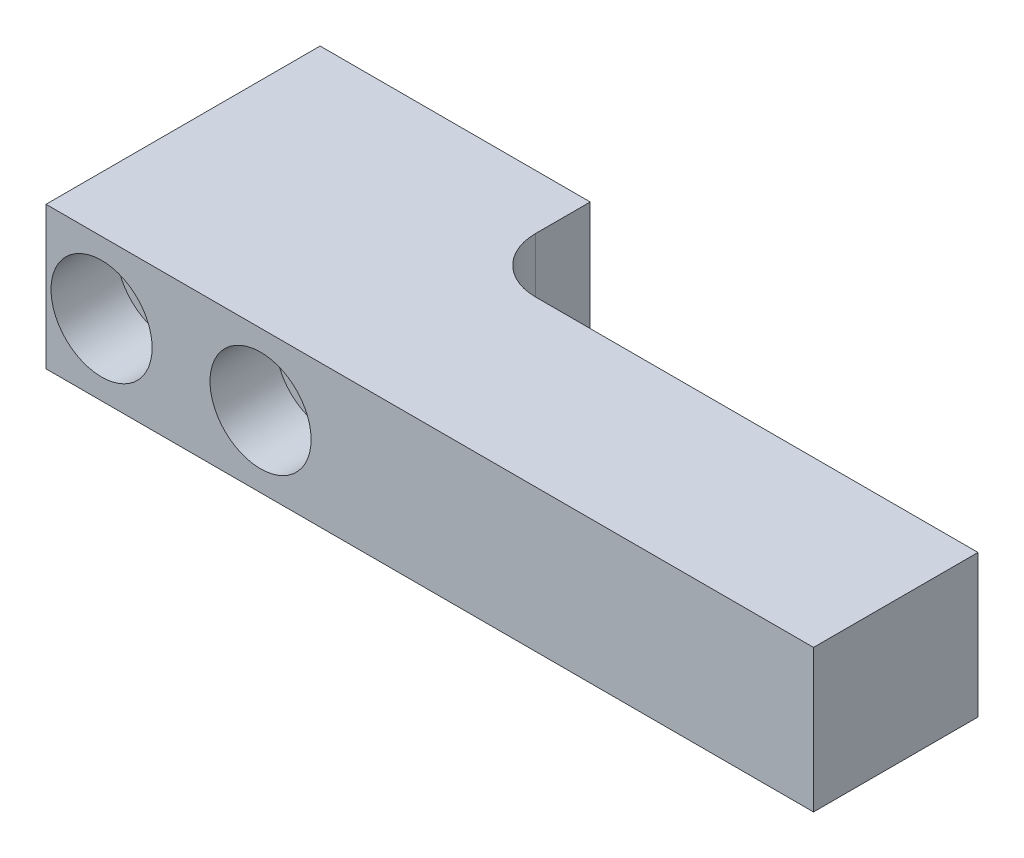
ISO-10303-21;
HEADER;
FILE_DESCRIPTION(('STEP AP214'),'2;1');
FILE_NAME('part.step','',(''),(''),'','','');
FILE_SCHEMA(('AUTOMOTIVE_DESIGN { 1 0 10303 214 1 1 1 1 }'));
ENDSEC;
DATA;
#1=APPLICATION_CONTEXT('core data for automotive mechanical design processes');
#2=APPLICATION_PROTOCOL_DEFINITION('international standard','automotive_design',2000,#1);
#3=PRODUCT_CONTEXT('',#1,'mechanical');
#4=PRODUCT('Part','Part','',(#3));
#5=PRODUCT_RELATED_PRODUCT_CATEGORY('part','',(#4));
#6=PRODUCT_DEFINITION_FORMATION('','',#4);
#7=PRODUCT_DEFINITION_CONTEXT('part definition',#1,'design');
#8=PRODUCT_DEFINITION('design','',#6,#7);
#9=PRODUCT_DEFINITION_SHAPE('','',#8);
#10=(LENGTH_UNIT() NAMED_UNIT(*) SI_UNIT(.MILLI.,.METRE.));
#11=(NAMED_UNIT(*) PLANE_ANGLE_UNIT() SI_UNIT($,.RADIAN.));
#12=(NAMED_UNIT(*) SI_UNIT($,.STERADIAN.) SOLID_ANGLE_UNIT());
#13=UNCERTAINTY_MEASURE_WITH_UNIT(LENGTH_MEASURE(1.E-05),#10,'distance_accuracy_value','');
#14=(GEOMETRIC_REPRESENTATION_CONTEXT(3) GLOBAL_UNCERTAINTY_ASSIGNED_CONTEXT((#13)) GLOBAL_UNIT_ASSIGNED_CONTEXT((#10,
#11,#12)) REPRESENTATION_CONTEXT('',''));
#15=CARTESIAN_POINT('',(0.,0.,0.));
#16=DIRECTION('',(0.,0.,1.));
#17=DIRECTION('',(1.,0.,0.));
#18=AXIS2_PLACEMENT_3D('',#15,#16,#17);
#19=CARTESIAN_POINT('',(19.567,6.5,25.));
#20=DIRECTION('',(0.,0.,-1.));
#21=DIRECTION('',(-1.,0.,0.));
#22=AXIS2_PLACEMENT_3D('',#19,#20,#21);
#23=CYLINDRICAL_SURFACE('',#22,2.68);
#24=CARTESIAN_POINT('',(19.567,6.5,0.));
#25=DIRECTION('',(0.,0.,-1.));
#26=DIRECTION('',(-1.,0.,0.));
#27=AXIS2_PLACEMENT_3D('',#24,#25,#26);
#28=CIRCLE('',#27,2.68);
#29=CARTESIAN_POINT('',(16.887,6.5,0.));
#30=VERTEX_POINT('',#29);
#31=EDGE_CURVE('E135',#30,#30,#28,.T.);
#32=ORIENTED_EDGE('',*,*,#31,.T.);
#33=EDGE_LOOP('',(#32));
#34=FACE_BOUND('',#33,.T.);
#35=CARTESIAN_POINT('',(19.567,6.5,19.));
#36=DIRECTION('',(0.,0.,1.));
#37=DIRECTION('',(1.,0.,0.));
#38=AXIS2_PLACEMENT_3D('',#35,#36,#37);
#39=CIRCLE('',#38,2.68);
#40=CARTESIAN_POINT('',(22.247,6.5,19.));
#41=VERTEX_POINT('',#40);
#42=EDGE_CURVE('E43',#41,#41,#39,.F.);
#43=ORIENTED_EDGE('',*,*,#42,.F.);
#44=EDGE_LOOP('',(#43));
#45=FACE_BOUND('',#44,.T.);
#46=ADVANCED_FACE('F39',(#34,#45),#23,.F.);
#47=CARTESIAN_POINT('',(5.067,6.5,25.));
#48=DIRECTION('',(0.,0.,-1.));
#49=DIRECTION('',(-1.,0.,0.));
#50=AXIS2_PLACEMENT_3D('',#47,#48,#49);
#51=CYLINDRICAL_SURFACE('',#50,2.68);
#52=CARTESIAN_POINT('',(5.067,6.5,0.));
#53=DIRECTION('',(0.,0.,-1.));
#54=DIRECTION('',(-1.,0.,0.));
#55=AXIS2_PLACEMENT_3D('',#52,#53,#54);
#56=CIRCLE('',#55,2.68);
#57=CARTESIAN_POINT('',(2.387,6.5,0.));
#58=VERTEX_POINT('',#57);
#59=EDGE_CURVE('E146',#58,#58,#56,.T.);
#60=ORIENTED_EDGE('',*,*,#59,.T.);
#61=EDGE_LOOP('',(#60));
#62=FACE_BOUND('',#61,.T.);
#63=CARTESIAN_POINT('',(5.067,6.5,19.));
#64=DIRECTION('',(0.,0.,1.));
#65=DIRECTION('',(1.,0.,0.));
#66=AXIS2_PLACEMENT_3D('',#63,#64,#65);
#67=CIRCLE('',#66,2.68);
#68=CARTESIAN_POINT('',(7.747,6.5,19.));
#69=VERTEX_POINT('',#68);
#70=EDGE_CURVE('E180',#69,#69,#67,.F.);
#71=ORIENTED_EDGE('',*,*,#70,.F.);
#72=EDGE_LOOP('',(#71));
#73=FACE_BOUND('',#72,.T.);
#74=ADVANCED_FACE('F243',(#62,#73),#51,.F.);
#75=CARTESIAN_POINT('',(0.,13.,10.));
#76=DIRECTION('',(1.,0.,0.));
#77=DIRECTION('',(0.,0.,-1.));
#78=AXIS2_PLACEMENT_3D('',#75,#76,#77);
#79=PLANE('',#78);
#80=DIRECTION('',(0.,-1.,0.));
#81=VECTOR('',#80,1.);
#82=CARTESIAN_POINT('',(0.,13.,0.));
#83=LINE('',#82,#81);
#84=CARTESIAN_POINT('',(0.,13.,0.));
#85=VERTEX_POINT('',#84);
#86=CARTESIAN_POINT('',(0.,0.,0.));
#87=VERTEX_POINT('',#86);
#88=EDGE_CURVE('E107',#85,#87,#83,.T.);
#89=ORIENTED_EDGE('',*,*,#88,.T.);
#90=DIRECTION('',(0.,0.,-1.));
#91=VECTOR('',#90,1.);
#92=CARTESIAN_POINT('',(0.,0.,10.));
#93=LINE('',#92,#91);
#94=CARTESIAN_POINT('',(0.,0.,25.));
#95=VERTEX_POINT('',#94);
#96=EDGE_CURVE('E100',#95,#87,#93,.T.);
#97=ORIENTED_EDGE('',*,*,#96,.F.);
#98=DIRECTION('',(0.,-1.,0.));
#99=VECTOR('',#98,1.);
#100=CARTESIAN_POINT('',(0.,0.,25.));
#101=LINE('',#100,#99);
#102=CARTESIAN_POINT('',(0.,13.,25.));
#103=VERTEX_POINT('',#102);
#104=EDGE_CURVE('E105',#103,#95,#101,.T.);
#105=ORIENTED_EDGE('',*,*,#104,.F.);
#106=DIRECTION('',(0.,0.,-1.));
#107=VECTOR('',#106,1.);
#108=CARTESIAN_POINT('',(0.,13.,10.));
#109=LINE('',#108,#107);
#110=EDGE_CURVE('E166',#103,#85,#109,.T.);
#111=ORIENTED_EDGE('',*,*,#110,.T.);
#112=EDGE_LOOP('',(#89,#97,#105,#111));
#113=FACE_BOUND('',#112,.T.);
#114=ADVANCED_FACE('F102',(#113),#79,.F.);
#115=CARTESIAN_POINT('',(0.,0.,10.));
#116=DIRECTION('',(0.,1.,0.));
#117=DIRECTION('',(0.,0.,1.));
#118=AXIS2_PLACEMENT_3D('',#115,#116,#117);
#119=PLANE('',#118);
#120=DIRECTION('',(1.,0.,0.));
#121=VECTOR('',#120,1.);
#122=CARTESIAN_POINT('',(0.,0.,0.));
#123=LINE('',#122,#121);
#124=CARTESIAN_POINT('',(24.634,0.,0.));
#125=VERTEX_POINT('',#124);
#126=EDGE_CURVE('E156',#87,#125,#123,.T.);
#127=ORIENTED_EDGE('',*,*,#126,.T.);
#128=DIRECTION('',(0.,0.,-1.));
#129=VECTOR('',#128,1.);
#130=CARTESIAN_POINT('',(24.634,0.,10.));
#131=LINE('',#130,#129);
#132=CARTESIAN_POINT('',(24.634,0.,5.));
#133=VERTEX_POINT('',#132);
#134=EDGE_CURVE('E112',#133,#125,#131,.T.);
#135=ORIENTED_EDGE('',*,*,#134,.F.);
#136=CARTESIAN_POINT('',(29.634,0.,5.));
#137=DIRECTION('',(0.,1.,0.));
#138=DIRECTION('',(0.,0.,1.));
#139=AXIS2_PLACEMENT_3D('',#136,#137,#138);
#140=CIRCLE('',#139,5.);
#141=CARTESIAN_POINT('',(29.634,0.,10.));
#142=VERTEX_POINT('',#141);
#143=EDGE_CURVE('E11',#133,#142,#140,.T.);
#144=ORIENTED_EDGE('',*,*,#143,.T.);
#145=DIRECTION('',(1.,0.,0.));
#146=VECTOR('',#145,1.);
#147=CARTESIAN_POINT('',(0.,0.,10.));
#148=LINE('',#147,#146);
#149=CARTESIAN_POINT('',(70.,0.,10.));
#150=VERTEX_POINT('',#149);
#151=EDGE_CURVE('E143',#142,#150,#148,.T.);
#152=ORIENTED_EDGE('',*,*,#151,.T.);
#153=DIRECTION('',(0.,0.,-1.));
#154=VECTOR('',#153,1.);
#155=CARTESIAN_POINT('',(70.,0.,25.));
#156=LINE('',#155,#154);
#157=CARTESIAN_POINT('',(70.,0.,25.));
#158=VERTEX_POINT('',#157);
#159=EDGE_CURVE('E118',#158,#150,#156,.T.);
#160=ORIENTED_EDGE('',*,*,#159,.F.);
#161=DIRECTION('',(1.,0.,0.));
#162=VECTOR('',#161,1.);
#163=CARTESIAN_POINT('',(0.,0.,25.));
#164=LINE('',#163,#162);
#165=EDGE_CURVE('E115',#95,#158,#164,.T.);
#166=ORIENTED_EDGE('',*,*,#165,.F.);
#167=ORIENTED_EDGE('',*,*,#96,.T.);
#168=EDGE_LOOP('',(#127,#135,#144,#152,#160,#166,#167));
#169=FACE_BOUND('',#168,.T.);
#170=ADVANCED_FACE('F116',(#169),#119,.F.);
#171=CARTESIAN_POINT('',(24.634,13.,10.));
#172=DIRECTION('',(-1.,0.,0.));
#173=DIRECTION('',(0.,0.,1.));
#174=AXIS2_PLACEMENT_3D('',#171,#172,#173);
#175=PLANE('',#174);
#176=DIRECTION('',(0.,0.,-1.));
#177=VECTOR('',#176,1.);
#178=CARTESIAN_POINT('',(24.634,13.,10.));
#179=LINE('',#178,#177);
#180=CARTESIAN_POINT('',(24.634,13.,5.));
#181=VERTEX_POINT('',#180);
#182=CARTESIAN_POINT('',(24.634,13.,0.));
#183=VERTEX_POINT('',#182);
#184=EDGE_CURVE('E169',#181,#183,#179,.T.);
#185=ORIENTED_EDGE('',*,*,#184,.F.);
#186=DIRECTION('',(0.,1.,0.));
#187=VECTOR('',#186,1.);
#188=CARTESIAN_POINT('',(24.634,13.,5.));
#189=LINE('',#188,#187);
#190=EDGE_CURVE('E57',#181,#133,#189,.F.);
#191=ORIENTED_EDGE('',*,*,#190,.T.);
#192=ORIENTED_EDGE('',*,*,#134,.T.);
#193=DIRECTION('',(0.,1.,0.));
#194=VECTOR('',#193,1.);
#195=CARTESIAN_POINT('',(24.634,13.,0.));
#196=LINE('',#195,#194);
#197=EDGE_CURVE('E159',#125,#183,#196,.T.);
#198=ORIENTED_EDGE('',*,*,#197,.T.);
#199=EDGE_LOOP('',(#185,#191,#192,#198));
#200=FACE_BOUND('',#199,.T.);
#201=ADVANCED_FACE('F335',(#200),#175,.F.);
#202=CARTESIAN_POINT('',(0.,13.,10.));
#203=DIRECTION('',(0.,-1.,0.));
#204=DIRECTION('',(1.,0.,0.));
#205=AXIS2_PLACEMENT_3D('',#202,#203,#204);
#206=PLANE('',#205);
#207=DIRECTION('',(-1.,0.,0.));
#208=VECTOR('',#207,1.);
#209=CARTESIAN_POINT('',(0.,13.,0.));
#210=LINE('',#209,#208);
#211=EDGE_CURVE('E163',#183,#85,#210,.T.);
#212=ORIENTED_EDGE('',*,*,#211,.T.);
#213=ORIENTED_EDGE('',*,*,#110,.F.);
#214=DIRECTION('',(-1.,0.,0.));
#215=VECTOR('',#214,1.);
#216=CARTESIAN_POINT('',(0.,13.,25.));
#217=LINE('',#216,#215);
#218=CARTESIAN_POINT('',(70.,13.,25.));
#219=VERTEX_POINT('',#218);
#220=EDGE_CURVE('E127',#219,#103,#217,.T.);
#221=ORIENTED_EDGE('',*,*,#220,.F.);
#222=DIRECTION('',(0.,0.,-1.));
#223=VECTOR('',#222,1.);
#224=CARTESIAN_POINT('',(70.,13.,25.));
#225=LINE('',#224,#223);
#226=CARTESIAN_POINT('',(70.,13.,10.));
#227=VERTEX_POINT('',#226);
#228=EDGE_CURVE('E142',#219,#227,#225,.T.);
#229=ORIENTED_EDGE('',*,*,#228,.T.);
#230=DIRECTION('',(-1.,0.,0.));
#231=VECTOR('',#230,1.);
#232=CARTESIAN_POINT('',(0.,13.,10.));
#233=LINE('',#232,#231);
#234=CARTESIAN_POINT('',(29.634,13.,10.));
#235=VERTEX_POINT('',#234);
#236=EDGE_CURVE('E129',#227,#235,#233,.T.);
#237=ORIENTED_EDGE('',*,*,#236,.T.);
#238=CARTESIAN_POINT('',(29.634,13.,5.));
#239=DIRECTION('',(0.,-1.,0.));
#240=DIRECTION('',(1.,0.,0.));
#241=AXIS2_PLACEMENT_3D('',#238,#239,#240);
#242=CIRCLE('',#241,5.);
#243=EDGE_CURVE('E49',#235,#181,#242,.T.);
#244=ORIENTED_EDGE('',*,*,#243,.T.);
#245=ORIENTED_EDGE('',*,*,#184,.T.);
#246=EDGE_LOOP('',(#212,#213,#221,#229,#237,#244,#245));
#247=FACE_BOUND('',#246,.T.);
#248=ADVANCED_FACE('F219',(#247),#206,.F.);
#249=CARTESIAN_POINT('',(0.,0.,0.));
#250=DIRECTION('',(0.,0.,1.));
#251=DIRECTION('',(1.,0.,0.));
#252=AXIS2_PLACEMENT_3D('',#249,#250,#251);
#253=PLANE('',#252);
#254=ORIENTED_EDGE('',*,*,#59,.F.);
#255=EDGE_LOOP('',(#254));
#256=FACE_BOUND('',#255,.T.);
#257=ORIENTED_EDGE('',*,*,#31,.F.);
#258=EDGE_LOOP('',(#257));
#259=FACE_BOUND('',#258,.T.);
#260=ORIENTED_EDGE('',*,*,#88,.F.);
#261=ORIENTED_EDGE('',*,*,#211,.F.);
#262=ORIENTED_EDGE('',*,*,#197,.F.);
#263=ORIENTED_EDGE('',*,*,#126,.F.);
#264=EDGE_LOOP('',(#260,#261,#262,#263));
#265=FACE_BOUND('',#264,.T.);
#266=ADVANCED_FACE('F215',(#256,#259,#265),#253,.F.);
#267=CARTESIAN_POINT('',(70.,0.,25.));
#268=DIRECTION('',(-1.,0.,0.));
#269=DIRECTION('',(0.,0.,1.));
#270=AXIS2_PLACEMENT_3D('',#267,#268,#269);
#271=PLANE('',#270);
#272=DIRECTION('',(0.,1.,0.));
#273=VECTOR('',#272,1.);
#274=CARTESIAN_POINT('',(70.,0.,10.));
#275=LINE('',#274,#273);
#276=EDGE_CURVE('E132',#150,#227,#275,.T.);
#277=ORIENTED_EDGE('',*,*,#276,.T.);
#278=ORIENTED_EDGE('',*,*,#228,.F.);
#279=DIRECTION('',(0.,1.,0.));
#280=VECTOR('',#279,1.);
#281=CARTESIAN_POINT('',(70.,0.,25.));
#282=LINE('',#281,#280);
#283=EDGE_CURVE('E122',#158,#219,#282,.T.);
#284=ORIENTED_EDGE('',*,*,#283,.F.);
#285=ORIENTED_EDGE('',*,*,#159,.T.);
#286=EDGE_LOOP('',(#277,#278,#284,#285));
#287=FACE_BOUND('',#286,.T.);
#288=ADVANCED_FACE('F218',(#287),#271,.F.);
#289=CARTESIAN_POINT('',(0.,0.,25.));
#290=DIRECTION('',(0.,0.,-1.));
#291=DIRECTION('',(-1.,0.,0.));
#292=AXIS2_PLACEMENT_3D('',#289,#290,#291);
#293=PLANE('',#292);
#294=CARTESIAN_POINT('',(5.067,6.5,25.));
#295=DIRECTION('',(0.,0.,1.));
#296=DIRECTION('',(1.,0.,0.));
#297=AXIS2_PLACEMENT_3D('',#294,#295,#296);
#298=CIRCLE('',#297,4.61);
#299=CARTESIAN_POINT('',(9.677,6.5,25.));
#300=VERTEX_POINT('',#299);
#301=EDGE_CURVE('E190',#300,#300,#298,.T.);
#302=ORIENTED_EDGE('',*,*,#301,.F.);
#303=EDGE_LOOP('',(#302));
#304=FACE_BOUND('',#303,.T.);
#305=CARTESIAN_POINT('',(19.567,6.5,25.));
#306=DIRECTION('',(0.,0.,1.));
#307=DIRECTION('',(1.,0.,0.));
#308=AXIS2_PLACEMENT_3D('',#305,#306,#307);
#309=CIRCLE('',#308,4.61);
#310=CARTESIAN_POINT('',(24.177,6.5,25.));
#311=VERTEX_POINT('',#310);
#312=EDGE_CURVE('E202',#311,#311,#309,.T.);
#313=ORIENTED_EDGE('',*,*,#312,.F.);
#314=EDGE_LOOP('',(#313));
#315=FACE_BOUND('',#314,.T.);
#316=ORIENTED_EDGE('',*,*,#104,.T.);
#317=ORIENTED_EDGE('',*,*,#165,.T.);
#318=ORIENTED_EDGE('',*,*,#283,.T.);
#319=ORIENTED_EDGE('',*,*,#220,.T.);
#320=EDGE_LOOP('',(#316,#317,#318,#319));
#321=FACE_BOUND('',#320,.T.);
#322=ADVANCED_FACE('F125',(#304,#315,#321),#293,.F.);
#323=CARTESIAN_POINT('',(0.,0.,10.));
#324=DIRECTION('',(0.,0.,-1.));
#325=DIRECTION('',(-1.,0.,0.));
#326=AXIS2_PLACEMENT_3D('',#323,#324,#325);
#327=PLANE('',#326);
#328=ORIENTED_EDGE('',*,*,#151,.F.);
#329=DIRECTION('',(0.,1.,0.));
#330=VECTOR('',#329,1.);
#331=CARTESIAN_POINT('',(29.634,0.,10.));
#332=LINE('',#331,#330);
#333=EDGE_CURVE('E111',#142,#235,#332,.T.);
#334=ORIENTED_EDGE('',*,*,#333,.T.);
#335=ORIENTED_EDGE('',*,*,#236,.F.);
#336=ORIENTED_EDGE('',*,*,#276,.F.);
#337=EDGE_LOOP('',(#328,#334,#335,#336));
#338=FACE_BOUND('',#337,.T.);
#339=ADVANCED_FACE('F230',(#338),#327,.T.);
#340=CARTESIAN_POINT('',(29.634,0.,5.));
#341=DIRECTION('',(0.,1.,0.));
#342=DIRECTION('',(0.,0.,1.));
#343=AXIS2_PLACEMENT_3D('',#340,#341,#342);
#344=CYLINDRICAL_SURFACE('',#343,5.);
#345=ORIENTED_EDGE('',*,*,#143,.F.);
#346=ORIENTED_EDGE('',*,*,#190,.F.);
#347=ORIENTED_EDGE('',*,*,#243,.F.);
#348=ORIENTED_EDGE('',*,*,#333,.F.);
#349=EDGE_LOOP('',(#345,#346,#347,#348));
#350=FACE_BOUND('',#349,.T.);
#351=ADVANCED_FACE('F41',(#350),#344,.F.);
#352=CARTESIAN_POINT('',(5.067,6.5,19.));
#353=DIRECTION('',(0.,0.,1.));
#354=DIRECTION('',(1.,0.,0.));
#355=AXIS2_PLACEMENT_3D('',#352,#353,#354);
#356=PLANE('',#355);
#357=CARTESIAN_POINT('',(5.067,6.5,19.));
#358=DIRECTION('',(0.,0.,1.));
#359=DIRECTION('',(1.,0.,0.));
#360=AXIS2_PLACEMENT_3D('',#357,#358,#359);
#361=CIRCLE('',#360,4.61);
#362=CARTESIAN_POINT('',(9.677,6.5,19.));
#363=VERTEX_POINT('',#362);
#364=EDGE_CURVE('E183',#363,#363,#361,.T.);
#365=ORIENTED_EDGE('',*,*,#364,.T.);
#366=EDGE_LOOP('',(#365));
#367=FACE_BOUND('',#366,.T.);
#368=ORIENTED_EDGE('',*,*,#70,.T.);
#369=EDGE_LOOP('',(#368));
#370=FACE_BOUND('',#369,.T.);
#371=ADVANCED_FACE('F254',(#367,#370),#356,.T.);
#372=CARTESIAN_POINT('',(5.067,6.5,19.));
#373=DIRECTION('',(0.,0.,1.));
#374=DIRECTION('',(1.,0.,0.));
#375=AXIS2_PLACEMENT_3D('',#372,#373,#374);
#376=CYLINDRICAL_SURFACE('',#375,4.61);
#377=ORIENTED_EDGE('',*,*,#364,.F.);
#378=EDGE_LOOP('',(#377));
#379=FACE_BOUND('',#378,.T.);
#380=ORIENTED_EDGE('',*,*,#301,.T.);
#381=EDGE_LOOP('',(#380));
#382=FACE_BOUND('',#381,.T.);
#383=ADVANCED_FACE('F258',(#379,#382),#376,.F.);
#384=CARTESIAN_POINT('',(19.567,6.5,19.));
#385=DIRECTION('',(0.,0.,1.));
#386=DIRECTION('',(1.,0.,0.));
#387=AXIS2_PLACEMENT_3D('',#384,#385,#386);
#388=PLANE('',#387);
#389=CARTESIAN_POINT('',(19.567,6.5,19.));
#390=DIRECTION('',(0.,0.,1.));
#391=DIRECTION('',(1.,0.,0.));
#392=AXIS2_PLACEMENT_3D('',#389,#390,#391);
#393=CIRCLE('',#392,4.61);
#394=CARTESIAN_POINT('',(24.177,6.5,19.));
#395=VERTEX_POINT('',#394);
#396=EDGE_CURVE('E196',#395,#395,#393,.T.);
#397=ORIENTED_EDGE('',*,*,#396,.T.);
#398=EDGE_LOOP('',(#397));
#399=FACE_BOUND('',#398,.T.);
#400=ORIENTED_EDGE('',*,*,#42,.T.);
#401=EDGE_LOOP('',(#400));
#402=FACE_BOUND('',#401,.T.);
#403=ADVANCED_FACE('F263',(#399,#402),#388,.T.);
#404=CARTESIAN_POINT('',(19.567,6.5,19.));
#405=DIRECTION('',(0.,0.,1.));
#406=DIRECTION('',(1.,0.,0.));
#407=AXIS2_PLACEMENT_3D('',#404,#405,#406);
#408=CYLINDRICAL_SURFACE('',#407,4.61);
#409=ORIENTED_EDGE('',*,*,#396,.F.);
#410=EDGE_LOOP('',(#409));
#411=FACE_BOUND('',#410,.T.);
#412=ORIENTED_EDGE('',*,*,#312,.T.);
#413=EDGE_LOOP('',(#412));
#414=FACE_BOUND('',#413,.T.);
#415=ADVANCED_FACE('F268',(#411,#414),#408,.F.);
#416=CLOSED_SHELL('',(#46,#74,#114,#170,#201,#248,#266,#288,#322,#339,#351,#371,#383,#403,#415));
#417=MANIFOLD_SOLID_BREP('B2',#416);
#418=ADVANCED_BREP_SHAPE_REPRESENTATION('',(#18,#417),#14);
#419=SHAPE_DEFINITION_REPRESENTATION(#9,#418);
ENDSEC;
END-ISO-10303-21;
